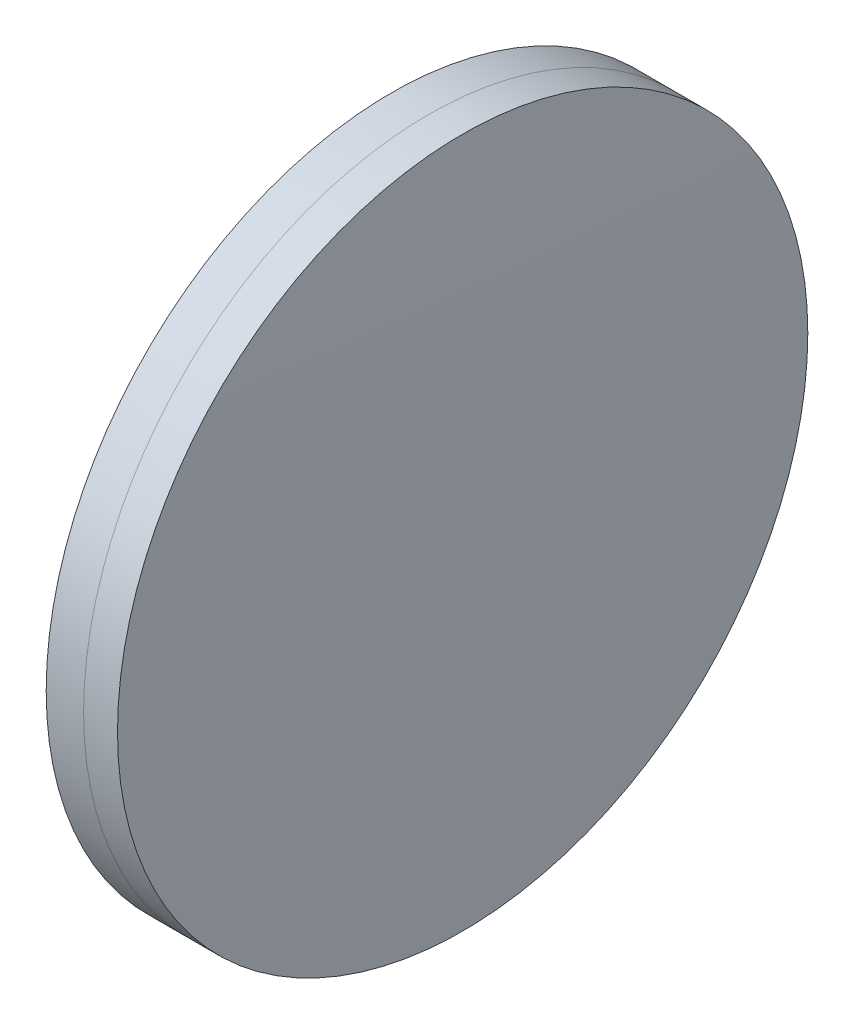
ISO-10303-21;
HEADER;
FILE_DESCRIPTION(('STEP AP214'),'2;1');
FILE_NAME('part.step','',(''),(''),'','','');
FILE_SCHEMA(('AUTOMOTIVE_DESIGN { 1 0 10303 214 1 1 1 1 }'));
ENDSEC;
DATA;
#1=APPLICATION_CONTEXT('core data for automotive mechanical design processes');
#2=APPLICATION_PROTOCOL_DEFINITION('international standard','automotive_design',2000,#1);
#3=PRODUCT_CONTEXT('',#1,'mechanical');
#4=PRODUCT('Part','Part','',(#3));
#5=PRODUCT_RELATED_PRODUCT_CATEGORY('part','',(#4));
#6=PRODUCT_DEFINITION_FORMATION('','',#4);
#7=PRODUCT_DEFINITION_CONTEXT('part definition',#1,'design');
#8=PRODUCT_DEFINITION('design','',#6,#7);
#9=PRODUCT_DEFINITION_SHAPE('','',#8);
#10=(LENGTH_UNIT() NAMED_UNIT(*) SI_UNIT(.MILLI.,.METRE.));
#11=(NAMED_UNIT(*) PLANE_ANGLE_UNIT() SI_UNIT($,.RADIAN.));
#12=(NAMED_UNIT(*) SI_UNIT($,.STERADIAN.) SOLID_ANGLE_UNIT());
#13=UNCERTAINTY_MEASURE_WITH_UNIT(LENGTH_MEASURE(1.E-05),#10,'distance_accuracy_value','');
#14=(GEOMETRIC_REPRESENTATION_CONTEXT(3) GLOBAL_UNCERTAINTY_ASSIGNED_CONTEXT((#13)) GLOBAL_UNIT_ASSIGNED_CONTEXT((#10,
#11,#12)) REPRESENTATION_CONTEXT('',''));
#15=CARTESIAN_POINT('',(0.,0.,0.));
#16=DIRECTION('',(0.,0.,1.));
#17=DIRECTION('',(1.,0.,0.));
#18=AXIS2_PLACEMENT_3D('',#15,#16,#17);
#19=CARTESIAN_POINT('',(216.121575906123,0.,0.));
#20=DIRECTION('',(-1.,0.,0.));
#21=DIRECTION('',(0.,0.,1.));
#22=AXIS2_PLACEMENT_3D('',#19,#20,#21);
#23=SPHERICAL_SURFACE('',#22,398.1);
#24=CARTESIAN_POINT('',(613.410450655971,0.,0.));
#25=DIRECTION('',(-1.,0.,0.));
#26=DIRECTION('',(0.,0.,1.));
#27=AXIS2_PLACEMENT_3D('',#24,#25,#26);
#28=CIRCLE('',#27,25.3999999999994);
#29=CARTESIAN_POINT('',(613.410450655971,0.,25.3999999999994));
#30=VERTEX_POINT('',#29);
#31=EDGE_CURVE('E11',#30,#30,#28,.T.);
#32=ORIENTED_EDGE('',*,*,#31,.T.);
#33=EDGE_LOOP('',(#32));
#34=FACE_BOUND('',#33,.T.);
#35=ADVANCED_FACE('F44',(#34),#23,.F.);
#36=CARTESIAN_POINT('',(-0.551919992657797,0.,0.));
#37=DIRECTION('',(-1.,0.,0.));
#38=DIRECTION('',(0.,0.,1.));
#39=AXIS2_PLACEMENT_3D('',#36,#37,#38);
#40=CYLINDRICAL_SURFACE('',#39,25.3999999999992);
#41=CARTESIAN_POINT('',(615.906292311994,0.,0.));
#42=DIRECTION('',(-1.,0.,0.));
#43=DIRECTION('',(0.,0.,1.));
#44=AXIS2_PLACEMENT_3D('',#41,#42,#43);
#45=CIRCLE('',#44,25.399999999999);
#46=CARTESIAN_POINT('',(615.906292311994,0.,25.399999999999));
#47=VERTEX_POINT('',#46);
#48=EDGE_CURVE('E50',#47,#47,#45,.T.);
#49=ORIENTED_EDGE('',*,*,#48,.T.);
#50=EDGE_LOOP('',(#49));
#51=FACE_BOUND('',#50,.T.);
#52=ORIENTED_EDGE('',*,*,#31,.F.);
#53=EDGE_LOOP('',(#52));
#54=FACE_BOUND('',#53,.T.);
#55=ADVANCED_FACE('F56',(#51,#54),#40,.T.);
#56=CARTESIAN_POINT('',(-407.078424093876,0.,0.));
#57=DIRECTION('',(-1.,0.,0.));
#58=DIRECTION('',(0.,0.,1.));
#59=AXIS2_PLACEMENT_3D('',#56,#57,#58);
#60=SPHERICAL_SURFACE('',#59,1023.3);
#61=ORIENTED_EDGE('',*,*,#48,.F.);
#62=EDGE_LOOP('',(#61));
#63=FACE_BOUND('',#62,.T.);
#64=ADVANCED_FACE('F59',(#63),#60,.T.);
#65=CLOSED_SHELL('',(#35,#55,#64));
#66=MANIFOLD_SOLID_BREP('B2',#65);
#67=CARTESIAN_POINT('',(1348.72157590612,0.,-2.38522468979738E-12));
#68=DIRECTION('',(-1.,0.,0.));
#69=DIRECTION('',(0.,0.,1.));
#70=AXIS2_PLACEMENT_3D('',#67,#68,#69);
#71=SPHERICAL_SURFACE('',#70,738.5);
#72=CARTESIAN_POINT('',(610.658509495129,0.,0.));
#73=DIRECTION('',(-1.,0.,0.));
#74=DIRECTION('',(0.,0.,1.));
#75=AXIS2_PLACEMENT_3D('',#72,#73,#74);
#76=CIRCLE('',#75,25.3999999999992);
#77=CARTESIAN_POINT('',(610.658509495129,0.,25.3999999999992));
#78=VERTEX_POINT('',#77);
#79=EDGE_CURVE('E43',#78,#78,#76,.T.);
#80=ORIENTED_EDGE('',*,*,#79,.T.);
#81=EDGE_LOOP('',(#80));
#82=FACE_BOUND('',#81,.T.);
#83=ADVANCED_FACE('F84',(#82),#71,.T.);
#84=CARTESIAN_POINT('',(124.523309526045,0.,0.));
#85=DIRECTION('',(-1.,0.,0.));
#86=DIRECTION('',(0.,0.,1.));
#87=AXIS2_PLACEMENT_3D('',#84,#85,#86);
#88=CYLINDRICAL_SURFACE('',#87,25.3999999999992);
#89=CARTESIAN_POINT('',(613.410450655971,0.,0.));
#90=DIRECTION('',(-1.,0.,0.));
#91=DIRECTION('',(0.,0.,1.));
#92=AXIS2_PLACEMENT_3D('',#89,#90,#91);
#93=CIRCLE('',#92,25.3999999999992);
#94=CARTESIAN_POINT('',(613.410450655971,0.,25.3999999999992));
#95=VERTEX_POINT('',#94);
#96=EDGE_CURVE('E90',#95,#95,#93,.T.);
#97=ORIENTED_EDGE('',*,*,#96,.T.);
#98=EDGE_LOOP('',(#97));
#99=FACE_BOUND('',#98,.T.);
#100=ORIENTED_EDGE('',*,*,#79,.F.);
#101=EDGE_LOOP('',(#100));
#102=FACE_BOUND('',#101,.T.);
#103=ADVANCED_FACE('F96',(#99,#102),#88,.T.);
#104=CARTESIAN_POINT('',(216.121575906123,0.,0.));
#105=DIRECTION('',(-1.,0.,0.));
#106=DIRECTION('',(0.,0.,1.));
#107=AXIS2_PLACEMENT_3D('',#104,#105,#106);
#108=SPHERICAL_SURFACE('',#107,398.1);
#109=ORIENTED_EDGE('',*,*,#96,.F.);
#110=EDGE_LOOP('',(#109));
#111=FACE_BOUND('',#110,.T.);
#112=ADVANCED_FACE('F99',(#111),#108,.T.);
#113=CLOSED_SHELL('',(#83,#103,#112));
#114=MANIFOLD_SOLID_BREP('B6',#113);
#115=ADVANCED_BREP_SHAPE_REPRESENTATION('',(#18,#66,#114),#14);
#116=SHAPE_DEFINITION_REPRESENTATION(#9,#115);
ENDSEC;
END-ISO-10303-21;
